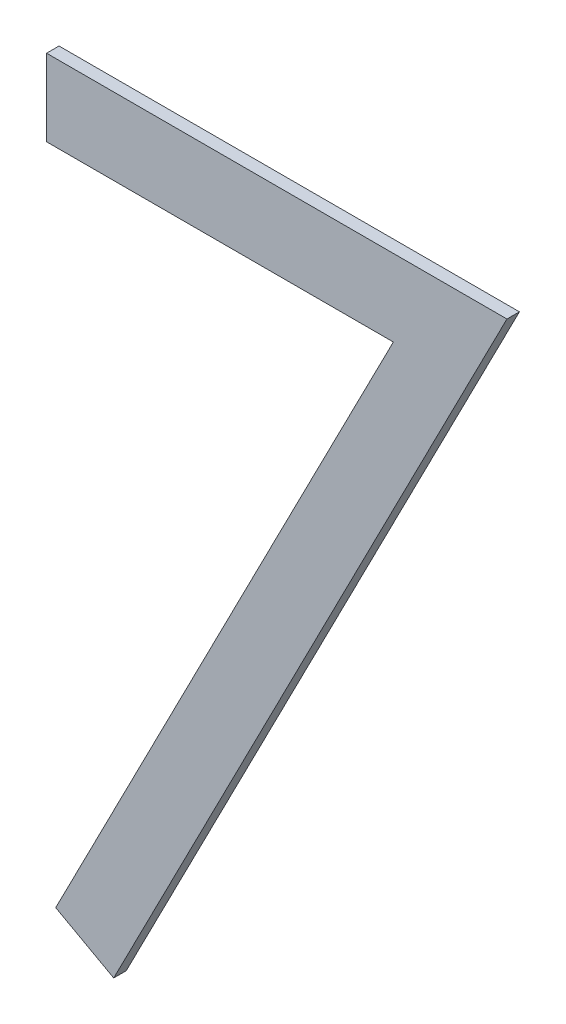
ISO-10303-21;
HEADER;
FILE_DESCRIPTION(('STEP AP214'),'2;1');
FILE_NAME('part.step','',(''),(''),'','','');
FILE_SCHEMA(('AUTOMOTIVE_DESIGN { 1 0 10303 214 1 1 1 1 }'));
ENDSEC;
DATA;
#1=APPLICATION_CONTEXT('core data for automotive mechanical design processes');
#2=APPLICATION_PROTOCOL_DEFINITION('international standard','automotive_design',2000,#1);
#3=PRODUCT_CONTEXT('',#1,'mechanical');
#4=PRODUCT('Part','Part','',(#3));
#5=PRODUCT_RELATED_PRODUCT_CATEGORY('part','',(#4));
#6=PRODUCT_DEFINITION_FORMATION('','',#4);
#7=PRODUCT_DEFINITION_CONTEXT('part definition',#1,'design');
#8=PRODUCT_DEFINITION('design','',#6,#7);
#9=PRODUCT_DEFINITION_SHAPE('','',#8);
#10=(LENGTH_UNIT() NAMED_UNIT(*) SI_UNIT(.MILLI.,.METRE.));
#11=(NAMED_UNIT(*) PLANE_ANGLE_UNIT() SI_UNIT($,.RADIAN.));
#12=(NAMED_UNIT(*) SI_UNIT($,.STERADIAN.) SOLID_ANGLE_UNIT());
#13=UNCERTAINTY_MEASURE_WITH_UNIT(LENGTH_MEASURE(1.E-05),#10,'distance_accuracy_value','');
#14=(GEOMETRIC_REPRESENTATION_CONTEXT(3) GLOBAL_UNCERTAINTY_ASSIGNED_CONTEXT((#13)) GLOBAL_UNIT_ASSIGNED_CONTEXT((#10,
#11,#12)) REPRESENTATION_CONTEXT('',''));
#15=CARTESIAN_POINT('',(0.,0.,0.));
#16=DIRECTION('',(0.,0.,1.));
#17=DIRECTION('',(1.,0.,0.));
#18=AXIS2_PLACEMENT_3D('',#15,#16,#17);
#19=CARTESIAN_POINT('',(1.18461538461538,0.24390475768074,0.551));
#20=DIRECTION('',(-1.,0.,0.));
#21=DIRECTION('',(0.,0.,1.));
#22=AXIS2_PLACEMENT_3D('',#19,#20,#21);
#23=PLANE('',#22);
#24=DIRECTION('',(0.,1.,0.));
#25=VECTOR('',#24,1.);
#26=CARTESIAN_POINT('',(1.18461538461538,0.24390475768074,0.55));
#27=LINE('',#26,#25);
#28=CARTESIAN_POINT('',(1.18461538461538,0.24390475768074,0.55));
#29=VERTEX_POINT('',#28);
#30=CARTESIAN_POINT('',(1.18461538461538,0.250058603834586,0.55));
#31=VERTEX_POINT('',#30);
#32=EDGE_CURVE('E11',#29,#31,#27,.T.);
#33=ORIENTED_EDGE('',*,*,#32,.F.);
#34=DIRECTION('',(0.,0.,-1.));
#35=VECTOR('',#34,1.);
#36=CARTESIAN_POINT('',(1.18461538461538,0.24390475768074,0.551));
#37=LINE('',#36,#35);
#38=CARTESIAN_POINT('',(1.18461538461538,0.24390475768074,0.551));
#39=VERTEX_POINT('',#38);
#40=EDGE_CURVE('E119',#39,#29,#37,.T.);
#41=ORIENTED_EDGE('',*,*,#40,.F.);
#42=DIRECTION('',(0.,1.,0.));
#43=VECTOR('',#42,1.);
#44=CARTESIAN_POINT('',(1.18461538461538,0.24390475768074,0.551));
#45=LINE('',#44,#43);
#46=CARTESIAN_POINT('',(1.18461538461538,0.250058603834586,0.551));
#47=VERTEX_POINT('',#46);
#48=EDGE_CURVE('E112',#39,#47,#45,.T.);
#49=ORIENTED_EDGE('',*,*,#48,.T.);
#50=DIRECTION('',(0.,0.,-1.));
#51=VECTOR('',#50,1.);
#52=CARTESIAN_POINT('',(1.18461538461538,0.250058603834586,0.551));
#53=LINE('',#52,#51);
#54=EDGE_CURVE('E85',#47,#31,#53,.T.);
#55=ORIENTED_EDGE('',*,*,#54,.T.);
#56=EDGE_LOOP('',(#33,#41,#49,#55));
#57=FACE_BOUND('',#56,.T.);
#58=ADVANCED_FACE('F17',(#57),#23,.T.);
#59=CARTESIAN_POINT('',(1.21242788461538,0.24390475768074,0.551));
#60=DIRECTION('',(0.,-1.,0.));
#61=DIRECTION('',(0.,0.,-1.));
#62=AXIS2_PLACEMENT_3D('',#59,#60,#61);
#63=PLANE('',#62);
#64=DIRECTION('',(-1.,0.,0.));
#65=VECTOR('',#64,1.);
#66=CARTESIAN_POINT('',(1.21242788461538,0.24390475768074,0.55));
#67=LINE('',#66,#65);
#68=CARTESIAN_POINT('',(1.21242788461538,0.24390475768074,0.55));
#69=VERTEX_POINT('',#68);
#70=EDGE_CURVE('E24',#69,#29,#67,.T.);
#71=ORIENTED_EDGE('',*,*,#70,.F.);
#72=DIRECTION('',(-2.22044604925006E-13,0.,-1.));
#73=VECTOR('',#72,1.);
#74=CARTESIAN_POINT('',(1.21242788461538,0.24390475768074,0.551));
#75=LINE('',#74,#73);
#76=CARTESIAN_POINT('',(1.21242788461538,0.24390475768074,0.551));
#77=VERTEX_POINT('',#76);
#78=EDGE_CURVE('E114',#77,#69,#75,.T.);
#79=ORIENTED_EDGE('',*,*,#78,.F.);
#80=DIRECTION('',(-1.,0.,0.));
#81=VECTOR('',#80,1.);
#82=CARTESIAN_POINT('',(1.21242788461538,0.24390475768074,0.551));
#83=LINE('',#82,#81);
#84=EDGE_CURVE('E103',#77,#39,#83,.T.);
#85=ORIENTED_EDGE('',*,*,#84,.T.);
#86=ORIENTED_EDGE('',*,*,#40,.T.);
#87=EDGE_LOOP('',(#71,#79,#85,#86));
#88=FACE_BOUND('',#87,.T.);
#89=ADVANCED_FACE('F127',(#88),#63,.T.);
#90=CARTESIAN_POINT('',(1.18534855769231,0.191080238449971,0.551));
#91=DIRECTION('',(-0.889887017756644,0.456180989989924,0.));
#92=DIRECTION('',(-0.456180989989924,-0.889887017756644,0.));
#93=AXIS2_PLACEMENT_3D('',#90,#91,#92);
#94=PLANE('',#93);
#95=DIRECTION('',(0.456180989989924,0.889887017756644,0.));
#96=VECTOR('',#95,1.);
#97=CARTESIAN_POINT('',(1.18534855769231,0.191080238449971,0.55));
#98=LINE('',#97,#96);
#99=CARTESIAN_POINT('',(1.18534855769231,0.191080238449971,0.55));
#100=VERTEX_POINT('',#99);
#101=EDGE_CURVE('E116',#100,#69,#98,.T.);
#102=ORIENTED_EDGE('',*,*,#101,.F.);
#103=DIRECTION('',(0.,0.,-1.));
#104=VECTOR('',#103,1.);
#105=CARTESIAN_POINT('',(1.18534855769231,0.191080238449971,0.551));
#106=LINE('',#105,#104);
#107=CARTESIAN_POINT('',(1.18534855769231,0.191080238449971,0.551));
#108=VERTEX_POINT('',#107);
#109=EDGE_CURVE('E106',#108,#100,#106,.T.);
#110=ORIENTED_EDGE('',*,*,#109,.F.);
#111=DIRECTION('',(0.456180989989924,0.889887017756644,0.));
#112=VECTOR('',#111,1.);
#113=CARTESIAN_POINT('',(1.18534855769231,0.191080238449971,0.551));
#114=LINE('',#113,#112);
#115=EDGE_CURVE('E96',#108,#77,#114,.T.);
#116=ORIENTED_EDGE('',*,*,#115,.T.);
#117=ORIENTED_EDGE('',*,*,#78,.T.);
#118=EDGE_LOOP('',(#102,#110,#116,#117));
#119=FACE_BOUND('',#118,.T.);
#120=ADVANCED_FACE('F123',(#119),#94,.T.);
#121=CARTESIAN_POINT('',(1.19,0.188520142296125,0.551));
#122=DIRECTION('',(-0.482179429384517,-0.876072484374679,0.));
#123=DIRECTION('',(0.876072484374679,-0.482179429384517,0.));
#124=AXIS2_PLACEMENT_3D('',#121,#122,#123);
#125=PLANE('',#124);
#126=DIRECTION('',(-0.876072484374673,0.482179429384528,0.));
#127=VECTOR('',#126,1.);
#128=CARTESIAN_POINT('',(1.19,0.188520142296125,0.55));
#129=LINE('',#128,#127);
#130=CARTESIAN_POINT('',(1.19,0.188520142296125,0.55));
#131=VERTEX_POINT('',#130);
#132=EDGE_CURVE('E109',#131,#100,#129,.T.);
#133=ORIENTED_EDGE('',*,*,#132,.F.);
#134=DIRECTION('',(0.,0.,-1.));
#135=VECTOR('',#134,1.);
#136=CARTESIAN_POINT('',(1.19,0.188520142296125,0.551));
#137=LINE('',#136,#135);
#138=CARTESIAN_POINT('',(1.19,0.188520142296125,0.551));
#139=VERTEX_POINT('',#138);
#140=EDGE_CURVE('E99',#139,#131,#137,.T.);
#141=ORIENTED_EDGE('',*,*,#140,.F.);
#142=DIRECTION('',(-0.876072484374673,0.482179429384528,0.));
#143=VECTOR('',#142,1.);
#144=CARTESIAN_POINT('',(1.19,0.188520142296125,0.551));
#145=LINE('',#144,#143);
#146=EDGE_CURVE('E79',#139,#108,#145,.T.);
#147=ORIENTED_EDGE('',*,*,#146,.T.);
#148=ORIENTED_EDGE('',*,*,#109,.T.);
#149=EDGE_LOOP('',(#133,#141,#147,#148));
#150=FACE_BOUND('',#149,.T.);
#151=ADVANCED_FACE('F125',(#150),#125,.T.);
#152=CARTESIAN_POINT('',(1.22153846153846,0.250058603834586,0.551));
#153=DIRECTION('',(0.889933250556876,-0.456090790910399,0.));
#154=DIRECTION('',(0.456090790910399,0.889933250556876,0.));
#155=AXIS2_PLACEMENT_3D('',#152,#153,#154);
#156=PLANE('',#155);
#157=DIRECTION('',(-0.456090790910398,-0.889933250556876,0.));
#158=VECTOR('',#157,1.);
#159=CARTESIAN_POINT('',(1.22153846153846,0.250058603834586,0.55));
#160=LINE('',#159,#158);
#161=CARTESIAN_POINT('',(1.22153846153846,0.250058603834586,0.55));
#162=VERTEX_POINT('',#161);
#163=EDGE_CURVE('E74',#162,#131,#160,.T.);
#164=ORIENTED_EDGE('',*,*,#163,.F.);
#165=DIRECTION('',(0.,0.,-1.));
#166=VECTOR('',#165,1.);
#167=CARTESIAN_POINT('',(1.22153846153846,0.250058603834586,0.551));
#168=LINE('',#167,#166);
#169=CARTESIAN_POINT('',(1.22153846153846,0.250058603834586,0.551));
#170=VERTEX_POINT('',#169);
#171=EDGE_CURVE('E66',#170,#162,#168,.T.);
#172=ORIENTED_EDGE('',*,*,#171,.F.);
#173=DIRECTION('',(-0.456090790910398,-0.889933250556876,0.));
#174=VECTOR('',#173,1.);
#175=CARTESIAN_POINT('',(1.22153846153846,0.250058603834586,0.551));
#176=LINE('',#175,#174);
#177=EDGE_CURVE('E71',#170,#139,#176,.T.);
#178=ORIENTED_EDGE('',*,*,#177,.T.);
#179=ORIENTED_EDGE('',*,*,#140,.T.);
#180=EDGE_LOOP('',(#164,#172,#178,#179));
#181=FACE_BOUND('',#180,.T.);
#182=ADVANCED_FACE('F68',(#181),#156,.T.);
#183=CARTESIAN_POINT('',(1.18461538461538,0.250058603834586,0.551));
#184=DIRECTION('',(0.,1.,0.));
#185=DIRECTION('',(0.,0.,1.));
#186=AXIS2_PLACEMENT_3D('',#183,#184,#185);
#187=PLANE('',#186);
#188=DIRECTION('',(1.,0.,0.));
#189=VECTOR('',#188,1.);
#190=CARTESIAN_POINT('',(1.18461538461538,0.250058603834586,0.55));
#191=LINE('',#190,#189);
#192=EDGE_CURVE('E78',#31,#162,#191,.T.);
#193=ORIENTED_EDGE('',*,*,#192,.F.);
#194=ORIENTED_EDGE('',*,*,#54,.F.);
#195=DIRECTION('',(1.,0.,0.));
#196=VECTOR('',#195,1.);
#197=CARTESIAN_POINT('',(1.18461538461538,0.250058603834586,0.551));
#198=LINE('',#197,#196);
#199=EDGE_CURVE('E83',#47,#170,#198,.T.);
#200=ORIENTED_EDGE('',*,*,#199,.T.);
#201=ORIENTED_EDGE('',*,*,#171,.T.);
#202=EDGE_LOOP('',(#193,#194,#200,#201));
#203=FACE_BOUND('',#202,.T.);
#204=ADVANCED_FACE('F84',(#203),#187,.T.);
#205=CARTESIAN_POINT('',(0.,0.,0.551));
#206=DIRECTION('',(0.,0.,-1.));
#207=DIRECTION('',(-1.,0.,0.));
#208=AXIS2_PLACEMENT_3D('',#205,#206,#207);
#209=PLANE('',#208);
#210=ORIENTED_EDGE('',*,*,#48,.F.);
#211=ORIENTED_EDGE('',*,*,#84,.F.);
#212=ORIENTED_EDGE('',*,*,#115,.F.);
#213=ORIENTED_EDGE('',*,*,#146,.F.);
#214=ORIENTED_EDGE('',*,*,#177,.F.);
#215=ORIENTED_EDGE('',*,*,#199,.F.);
#216=EDGE_LOOP('',(#210,#211,#212,#213,#214,#215));
#217=FACE_BOUND('',#216,.T.);
#218=ADVANCED_FACE('F89',(#217),#209,.F.);
#219=CARTESIAN_POINT('',(0.,0.,0.55));
#220=DIRECTION('',(0.,0.,-1.));
#221=DIRECTION('',(-1.,0.,0.));
#222=AXIS2_PLACEMENT_3D('',#219,#220,#221);
#223=PLANE('',#222);
#224=ORIENTED_EDGE('',*,*,#32,.T.);
#225=ORIENTED_EDGE('',*,*,#192,.T.);
#226=ORIENTED_EDGE('',*,*,#163,.T.);
#227=ORIENTED_EDGE('',*,*,#132,.T.);
#228=ORIENTED_EDGE('',*,*,#101,.T.);
#229=ORIENTED_EDGE('',*,*,#70,.T.);
#230=EDGE_LOOP('',(#224,#225,#226,#227,#228,#229));
#231=FACE_BOUND('',#230,.T.);
#232=ADVANCED_FACE('F121',(#231),#223,.T.);
#233=CLOSED_SHELL('',(#58,#89,#120,#151,#182,#204,#218,#232));
#234=MANIFOLD_SOLID_BREP('B1',#233);
#235=ADVANCED_BREP_SHAPE_REPRESENTATION('',(#18,#234),#14);
#236=SHAPE_DEFINITION_REPRESENTATION(#9,#235);
ENDSEC;
END-ISO-10303-21;
